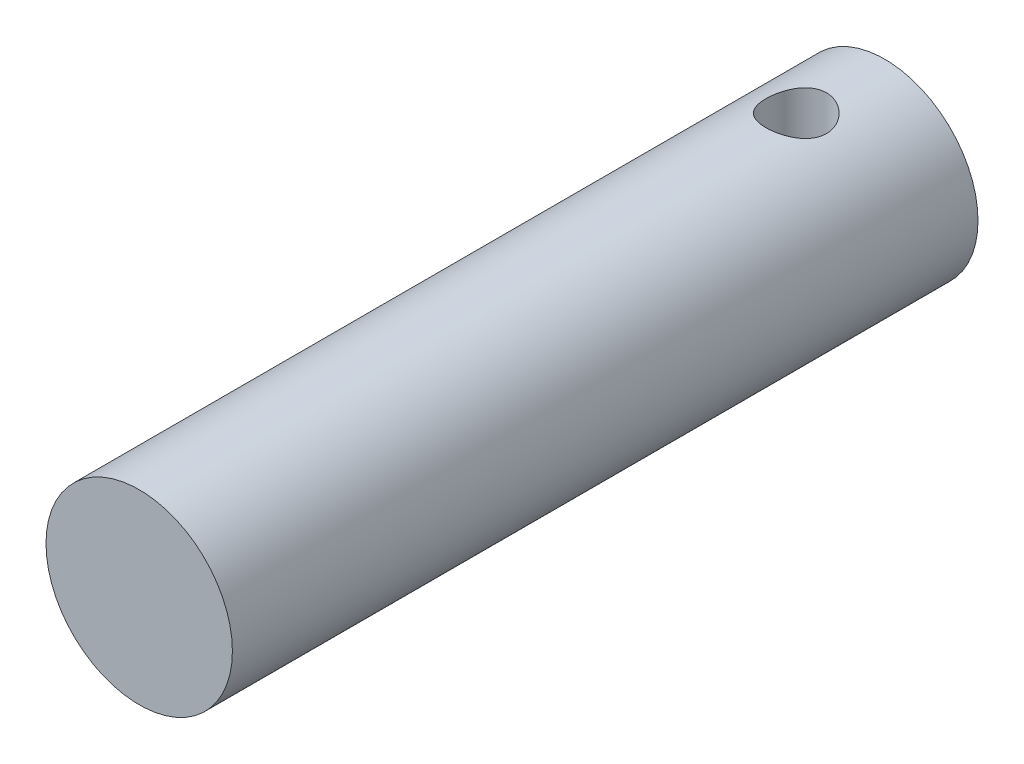
ISO-10303-21;
HEADER;
FILE_DESCRIPTION(('STEP AP214'),'2;1');
FILE_NAME('part.step','',(''),(''),'','','');
FILE_SCHEMA(('AUTOMOTIVE_DESIGN { 1 0 10303 214 1 1 1 1 }'));
ENDSEC;
DATA;
#1=APPLICATION_CONTEXT('core data for automotive mechanical design processes');
#2=APPLICATION_PROTOCOL_DEFINITION('international standard','automotive_design',2000,#1);
#3=PRODUCT_CONTEXT('',#1,'mechanical');
#4=PRODUCT('Part','Part','',(#3));
#5=PRODUCT_RELATED_PRODUCT_CATEGORY('part','',(#4));
#6=PRODUCT_DEFINITION_FORMATION('','',#4);
#7=PRODUCT_DEFINITION_CONTEXT('part definition',#1,'design');
#8=PRODUCT_DEFINITION('design','',#6,#7);
#9=PRODUCT_DEFINITION_SHAPE('','',#8);
#10=(LENGTH_UNIT() NAMED_UNIT(*) SI_UNIT(.MILLI.,.METRE.));
#11=(NAMED_UNIT(*) PLANE_ANGLE_UNIT() SI_UNIT($,.RADIAN.));
#12=(NAMED_UNIT(*) SI_UNIT($,.STERADIAN.) SOLID_ANGLE_UNIT());
#13=UNCERTAINTY_MEASURE_WITH_UNIT(LENGTH_MEASURE(1.E-05),#10,'distance_accuracy_value','');
#14=(GEOMETRIC_REPRESENTATION_CONTEXT(3) GLOBAL_UNCERTAINTY_ASSIGNED_CONTEXT((#13)) GLOBAL_UNIT_ASSIGNED_CONTEXT((#10,
#11,#12)) REPRESENTATION_CONTEXT('',''));
#15=CARTESIAN_POINT('',(0.,0.,0.));
#16=DIRECTION('',(0.,0.,1.));
#17=DIRECTION('',(1.,0.,0.));
#18=AXIS2_PLACEMENT_3D('',#15,#16,#17);
#19=CARTESIAN_POINT('',(0.,0.,80.));
#20=DIRECTION('',(0.,0.,-1.));
#21=DIRECTION('',(-1.,0.,0.));
#22=AXIS2_PLACEMENT_3D('',#19,#20,#21);
#23=CYLINDRICAL_SURFACE('',#22,10.);
#24=CARTESIAN_POINT('',(0.,-10.,12.75));
#25=CARTESIAN_POINT('',(0.177579382949037,-9.99999989374565,12.7499999788935));
#26=CARTESIAN_POINT('',(0.355160799428112,-9.99522579386108,12.7353980365284));
#27=CARTESIAN_POINT('',(0.705108112257464,-9.97665017824227,12.6775443332715));
#28=CARTESIAN_POINT('',(0.877473205641299,-9.96284727999528,12.6342881847613));
#29=CARTESIAN_POINT('',(1.21189182680224,-9.92771716006862,12.5207547728247));
#30=CARTESIAN_POINT('',(1.37396158278686,-9.90640214525769,12.4505213298079));
#31=CARTESIAN_POINT('',(1.68402262402101,-9.85843361438871,12.2852203482162));
#32=CARTESIAN_POINT('',(1.83201134569424,-9.83177912896556,12.1901482993111));
#33=CARTESIAN_POINT('',(2.11461081148199,-9.77495932247796,11.9745589387076));
#34=CARTESIAN_POINT('',(2.24869037174637,-9.74471295358528,11.8533668062036));
#35=CARTESIAN_POINT('',(2.49502344091046,-9.6845736848256,11.5904130339127));
#36=CARTESIAN_POINT('',(2.6072724549812,-9.65468085893924,11.4486471685403));
#37=CARTESIAN_POINT('',(2.80972801137824,-9.59775056049016,11.1438629732491));
#38=CARTESIAN_POINT('',(2.89925504445897,-9.57081237727236,10.9803729502016));
#39=CARTESIAN_POINT('',(3.049318871398,-9.52406830823476,10.6396400997919));
#40=CARTESIAN_POINT('',(3.10986401524675,-9.50426036852437,10.4624012507344));
#41=CARTESIAN_POINT('',(3.19827260971519,-9.4748706234853,10.1052240034781));
#42=CARTESIAN_POINT('',(3.2271274104268,-9.46497952226558,9.92555717035662));
#43=CARTESIAN_POINT('',(3.25443459132067,-9.45562707493594,9.56368104299375));
#44=CARTESIAN_POINT('',(3.25289582251765,-9.45616269242515,9.38147250437639));
#45=CARTESIAN_POINT('',(3.22023155138037,-9.46733131423128,9.02803492164185));
#46=CARTESIAN_POINT('',(3.19038591816139,-9.47752750417874,8.8566714242638));
#47=CARTESIAN_POINT('',(3.10403782395807,-9.50615574812355,8.52153026618225));
#48=CARTESIAN_POINT('',(3.04753231830217,-9.52458874278654,8.35775347425966));
#49=CARTESIAN_POINT('',(2.9086040418874,-9.56793440052134,8.03946972523123));
#50=CARTESIAN_POINT('',(2.82579288678077,-9.59294312913819,7.88514594174321));
#51=CARTESIAN_POINT('',(2.63687365185911,-9.64658062480913,7.59217407032713));
#52=CARTESIAN_POINT('',(2.53075911343127,-9.6752103945125,7.45353034435166));
#53=CARTESIAN_POINT('',(2.29204406554379,-9.73459644737762,7.18864419467052));
#54=CARTESIAN_POINT('',(2.15839298888212,-9.76538786414675,7.06335456075029));
#55=CARTESIAN_POINT('',(1.87159594889807,-9.82438470108506,6.83672493383306));
#56=CARTESIAN_POINT('',(1.71844829781997,-9.85258989700936,6.73538701643118));
#57=CARTESIAN_POINT('',(1.39505996296231,-9.90357541398691,6.55882041963745));
#58=CARTESIAN_POINT('',(1.22467751353947,-9.92630448856869,6.48383558140145));
#59=CARTESIAN_POINT('',(0.872803501369059,-9.96340575158467,6.36388245090137));
#60=CARTESIAN_POINT('',(0.69131562065941,-9.97778069343972,6.31890426808364));
#61=CARTESIAN_POINT('',(0.330457295677714,-9.99610319938068,6.26190268958609));
#62=CARTESIAN_POINT('',(0.151310774152583,-10.0004581918424,6.24859087614171));
#63=CARTESIAN_POINT('',(-0.206684753642986,-9.99946515119833,6.25164499537228));
#64=CARTESIAN_POINT('',(-0.385533802797546,-9.99411866512874,6.26800619627043));
#65=CARTESIAN_POINT('',(-0.732777014929081,-9.97459190888947,6.32891612541361));
#66=CARTESIAN_POINT('',(-0.901323284372865,-9.96065655544011,6.37268387411816));
#67=CARTESIAN_POINT('',(-1.22862125569252,-9.92560343144515,6.48619763987108));
#68=CARTESIAN_POINT('',(-1.38737171915065,-9.90448475494932,6.55594693377962));
#69=CARTESIAN_POINT('',(-1.69509055480488,-9.85654869030637,6.7214272702345));
#70=CARTESIAN_POINT('',(-1.84370519348154,-9.82959944293602,6.8177768248749));
#71=CARTESIAN_POINT('',(-2.12308150730875,-9.77306882676684,7.03298990397325));
#72=CARTESIAN_POINT('',(-2.25383795390917,-9.74348669127606,7.151859997817));
#73=CARTESIAN_POINT('',(-2.49964097258612,-9.68341394517995,7.41480097804423));
#74=CARTESIAN_POINT('',(-2.61376838975716,-9.65293908057767,7.55973674123745));
#75=CARTESIAN_POINT('',(-2.81618275812033,-9.59584349220032,7.86736100265518));
#76=CARTESIAN_POINT('',(-2.90446977360854,-9.56922275883548,8.03004945670606));
#77=CARTESIAN_POINT('',(-3.05222465357593,-9.52312626728824,8.3684525393954));
#78=CARTESIAN_POINT('',(-3.11177462835522,-9.50363019104654,8.54412838046303));
#79=CARTESIAN_POINT('',(-3.20020095668876,-9.47422438151486,8.90378778157255));
#80=CARTESIAN_POINT('',(-3.22909023717128,-9.4643106083648,9.08776780633169));
#81=CARTESIAN_POINT('',(-3.25439854839941,-9.45563586870718,9.44914011744297));
#82=CARTESIAN_POINT('',(-3.25233581624123,-9.45635339998916,9.62641479309743));
#83=CARTESIAN_POINT('',(-3.21950614466644,-9.46758016662914,9.97795399616682));
#84=CARTESIAN_POINT('',(-3.18874075712543,-9.47808887260453,10.1522186858048));
#85=CARTESIAN_POINT('',(-3.10043070730134,-9.50733511912922,10.4898321057282));
#86=CARTESIAN_POINT('',(-3.04335434275121,-9.52592844913925,10.6533167867785));
#87=CARTESIAN_POINT('',(-2.90441722996809,-9.5692021691022,10.9685171754486));
#88=CARTESIAN_POINT('',(-2.82255115849537,-9.59388386623479,11.1202303465038));
#89=CARTESIAN_POINT('',(-2.63235879697991,-9.64784088636398,11.4144561834634));
#90=CARTESIAN_POINT('',(-2.52306891129123,-9.67726517521805,11.5563185213747));
#91=CARTESIAN_POINT('',(-2.28278717900075,-9.73674387050347,11.8201809069832));
#92=CARTESIAN_POINT('',(-2.15178933442872,-9.76679844907541,11.9421754466285));
#93=CARTESIAN_POINT('',(-1.86608754817447,-9.82546252093759,12.1672967982182));
#94=CARTESIAN_POINT('',(-1.71069498742675,-9.85397977542082,12.2695765881428));
#95=CARTESIAN_POINT('',(-1.38400159009725,-9.90514098282108,12.4464406536773));
#96=CARTESIAN_POINT('',(-1.21270574929994,-9.92778677175249,12.5210335901562));
#97=CARTESIAN_POINT('',(-0.869832380696063,-9.96349655119001,12.6363330359905));
#98=CARTESIAN_POINT('',(-0.698908003473846,-9.97706030755102,12.6788273892005));
#99=CARTESIAN_POINT('',(-0.351988917437684,-9.9953110007797,12.7356574435725));
#100=CARTESIAN_POINT('',(-0.175995457426611,-10.0000001053066,12.7500000209183));
#101=CARTESIAN_POINT('',(0.,-10.,12.75));
#102=B_SPLINE_CURVE_WITH_KNOTS('',3,(#24,#25,#26,#27,#28,#29,#30,#31,#32,#33,#34,#35,#36,#37,
#38,#39,#40,#41,#42,#43,#44,#45,#46,#47,#48,#49,#50,#51,#52,#53,#54,#55,#56,#57,#58,#59,#60,#61,
#62,#63,#64,#65,#66,#67,#68,#69,#70,#71,#72,#73,#74,#75,#76,#77,#78,#79,#80,#81,#82,#83,#84,#85,
#86,#87,#88,#89,#90,#91,#92,#93,#94,#95,#96,#97,#98,#99,#100,#101),.UNSPECIFIED.,.T.,.F.,(4,2,2,
2,2,2,2,2,2,2,2,2,2,2,2,2,2,2,2,2,2,2,2,2,2,2,2,2,2,2,2,2,2,2,2,2,2,2,4),(0.,0.532090801254678,
1.06426309669592,1.59557459199055,2.12698263287681,2.67425296309553,3.22163585524026,
3.78384740278184,4.34589687356045,4.88981368187708,5.43357209666657,5.95386117923412,
6.47420969543027,7.0026288286568,7.53119460031028,8.08590846442153,8.64067038102186,
9.2004380558259,9.76002113320907,10.2964148728263,10.8327230844865,11.3544036147969,
11.8761499631049,12.4112318399367,12.9464700445872,13.5047604456698,14.0630494576023,
14.6197336846483,15.176183113382,15.7054311330744,16.2346505394039,16.7547941299287,
17.275049493252,17.8170673976499,18.3592353135956,18.9211107593865,19.4828102935623,
20.0102839458811,20.5376287446081),.UNSPECIFIED.);
#103=CARTESIAN_POINT('',(0.,-10.,12.75));
#104=VERTEX_POINT('',#103);
#105=EDGE_CURVE('E39',#104,#104,#102,.T.);
#106=ORIENTED_EDGE('',*,*,#105,.T.);
#107=EDGE_LOOP('',(#106));
#108=FACE_BOUND('',#107,.T.);
#109=CARTESIAN_POINT('',(0.,10.,12.75));
#110=CARTESIAN_POINT('',(-0.17757938294903,9.99999989374565,12.7499999788935));
#111=CARTESIAN_POINT('',(-0.355160799428105,9.99522579386108,12.7353980365284));
#112=CARTESIAN_POINT('',(-0.705108112257457,9.97665017824228,12.6775443332715));
#113=CARTESIAN_POINT('',(-0.877473205641292,9.96284727999529,12.6342881847613));
#114=CARTESIAN_POINT('',(-1.21189182680223,9.92771716006863,12.5207547728247));
#115=CARTESIAN_POINT('',(-1.37396158278685,9.90640214525769,12.4505213298079));
#116=CARTESIAN_POINT('',(-1.684022624021,9.85843361438871,12.2852203482162));
#117=CARTESIAN_POINT('',(-1.83201134569423,9.83177912896556,12.1901482993111));
#118=CARTESIAN_POINT('',(-2.11461081148198,9.77495932247796,11.9745589387076));
#119=CARTESIAN_POINT('',(-2.24869037174636,9.74471295358528,11.8533668062036));
#120=CARTESIAN_POINT('',(-2.49502344091045,9.6845736848256,11.5904130339127));
#121=CARTESIAN_POINT('',(-2.60727245498119,9.65468085893924,11.4486471685403));
#122=CARTESIAN_POINT('',(-2.80972801137823,9.59775056049016,11.1438629732491));
#123=CARTESIAN_POINT('',(-2.89925504445896,9.57081237727236,10.9803729502016));
#124=CARTESIAN_POINT('',(-3.04931887139799,9.52406830823476,10.6396400997919));
#125=CARTESIAN_POINT('',(-3.10986401524674,9.50426036852437,10.4624012507344));
#126=CARTESIAN_POINT('',(-3.19827260971519,9.4748706234853,10.1052240034781));
#127=CARTESIAN_POINT('',(-3.2271274104268,9.46497952226559,9.92555717035662));
#128=CARTESIAN_POINT('',(-3.25443459132067,9.45562707493594,9.56368104299375));
#129=CARTESIAN_POINT('',(-3.25289582251765,9.45616269242515,9.38147250437639));
#130=CARTESIAN_POINT('',(-3.22023155138037,9.46733131423128,9.02803492164185));
#131=CARTESIAN_POINT('',(-3.19038591816138,9.47752750417874,8.8566714242638));
#132=CARTESIAN_POINT('',(-3.10403782395806,9.50615574812356,8.52153026618225));
#133=CARTESIAN_POINT('',(-3.04753231830216,9.52458874278654,8.35775347425966));
#134=CARTESIAN_POINT('',(-2.90860404188739,9.56793440052134,8.03946972523123));
#135=CARTESIAN_POINT('',(-2.82579288678076,9.5929431291382,7.88514594174321));
#136=CARTESIAN_POINT('',(-2.6368736518591,9.64658062480913,7.59217407032713));
#137=CARTESIAN_POINT('',(-2.53075911343127,9.6752103945125,7.45353034435166));
#138=CARTESIAN_POINT('',(-2.29204406554378,9.73459644737762,7.18864419467052));
#139=CARTESIAN_POINT('',(-2.15839298888211,9.76538786414675,7.06335456075029));
#140=CARTESIAN_POINT('',(-1.87159594889806,9.82438470108506,6.83672493383306));
#141=CARTESIAN_POINT('',(-1.71844829781996,9.85258989700936,6.73538701643118));
#142=CARTESIAN_POINT('',(-1.3950599629623,9.90357541398691,6.55882041963745));
#143=CARTESIAN_POINT('',(-1.22467751353946,9.92630448856869,6.48383558140145));
#144=CARTESIAN_POINT('',(-0.872803501369051,9.96340575158467,6.36388245090137));
#145=CARTESIAN_POINT('',(-0.691315620659402,9.97778069343972,6.31890426808364));
#146=CARTESIAN_POINT('',(-0.330457295677706,9.99610319938068,6.26190268958609));
#147=CARTESIAN_POINT('',(-0.151310774152576,10.0004581918424,6.24859087614171));
#148=CARTESIAN_POINT('',(0.206684753642994,9.99946515119833,6.25164499537228));
#149=CARTESIAN_POINT('',(0.385533802797554,9.99411866512873,6.26800619627043));
#150=CARTESIAN_POINT('',(0.732777014929089,9.97459190888947,6.32891612541361));
#151=CARTESIAN_POINT('',(0.901323284372872,9.96065655544011,6.37268387411816));
#152=CARTESIAN_POINT('',(1.22862125569253,9.92560343144515,6.48619763987108));
#153=CARTESIAN_POINT('',(1.38737171915066,9.90448475494932,6.55594693377962));
#154=CARTESIAN_POINT('',(1.69509055480489,9.85654869030636,6.7214272702345));
#155=CARTESIAN_POINT('',(1.84370519348155,9.82959944293601,6.8177768248749));
#156=CARTESIAN_POINT('',(2.12308150730875,9.77306882676684,7.03298990397325));
#157=CARTESIAN_POINT('',(2.25383795390918,9.74348669127605,7.151859997817));
#158=CARTESIAN_POINT('',(2.49964097258612,9.68341394517995,7.41480097804423));
#159=CARTESIAN_POINT('',(2.61376838975717,9.65293908057767,7.55973674123745));
#160=CARTESIAN_POINT('',(2.81618275812033,9.59584349220032,7.86736100265518));
#161=CARTESIAN_POINT('',(2.90446977360854,9.56922275883548,8.03004945670606));
#162=CARTESIAN_POINT('',(3.05222465357594,9.52312626728824,8.3684525393954));
#163=CARTESIAN_POINT('',(3.11177462835522,9.50363019104654,8.54412838046303));
#164=CARTESIAN_POINT('',(3.20020095668876,9.47422438151486,8.90378778157254));
#165=CARTESIAN_POINT('',(3.22909023717129,9.4643106083648,9.08776780633168));
#166=CARTESIAN_POINT('',(3.25439854839942,9.45563586870717,9.44914011744297));
#167=CARTESIAN_POINT('',(3.25233581624124,9.45635339998916,9.62641479309743));
#168=CARTESIAN_POINT('',(3.21950614466645,9.46758016662914,9.97795399616682));
#169=CARTESIAN_POINT('',(3.18874075712544,9.47808887260453,10.1522186858048));
#170=CARTESIAN_POINT('',(3.10043070730134,9.50733511912922,10.4898321057282));
#171=CARTESIAN_POINT('',(3.04335434275122,9.52592844913925,10.6533167867785));
#172=CARTESIAN_POINT('',(2.9044172299681,9.56920216910219,10.9685171754486));
#173=CARTESIAN_POINT('',(2.82255115849538,9.59388386623479,11.1202303465038));
#174=CARTESIAN_POINT('',(2.63235879697992,9.64784088636397,11.4144561834634));
#175=CARTESIAN_POINT('',(2.52306891129124,9.67726517521804,11.5563185213747));
#176=CARTESIAN_POINT('',(2.28278717900076,9.73674387050347,11.8201809069832));
#177=CARTESIAN_POINT('',(2.15178933442872,9.76679844907541,11.9421754466285));
#178=CARTESIAN_POINT('',(1.86608754817448,9.82546252093759,12.1672967982182));
#179=CARTESIAN_POINT('',(1.71069498742676,9.85397977542082,12.2695765881428));
#180=CARTESIAN_POINT('',(1.38400159009726,9.90514098282108,12.4464406536773));
#181=CARTESIAN_POINT('',(1.21270574929995,9.92778677175249,12.5210335901562));
#182=CARTESIAN_POINT('',(0.869832380696071,9.96349655119002,12.6363330359905));
#183=CARTESIAN_POINT('',(0.698908003473853,9.97706030755102,12.6788273892005));
#184=CARTESIAN_POINT('',(0.351988917437691,9.9953110007797,12.7356574435725));
#185=CARTESIAN_POINT('',(0.175995457426618,10.0000001053066,12.7500000209183));
#186=CARTESIAN_POINT('',(0.,10.,12.75));
#187=B_SPLINE_CURVE_WITH_KNOTS('',3,(#109,#110,#111,#112,#113,#114,#115,#116,#117,#118,#119,
#120,#121,#122,#123,#124,#125,#126,#127,#128,#129,#130,#131,#132,#133,#134,#135,#136,#137,#138,
#139,#140,#141,#142,#143,#144,#145,#146,#147,#148,#149,#150,#151,#152,#153,#154,#155,#156,#157,
#158,#159,#160,#161,#162,#163,#164,#165,#166,#167,#168,#169,#170,#171,#172,#173,#174,#175,#176,
#177,#178,#179,#180,#181,#182,#183,#184,#185,#186),.UNSPECIFIED.,.T.,.F.,(4,2,2,2,2,2,2,2,2,2,2,
2,2,2,2,2,2,2,2,2,2,2,2,2,2,2,2,2,2,2,2,2,2,2,2,2,2,2,4),(0.,0.532090801254678,1.06426309669592,
1.59557459199055,2.12698263287681,2.67425296309553,3.22163585524026,3.78384740278184,
4.34589687356045,4.88981368187708,5.43357209666657,5.95386117923412,6.47420969543027,
7.0026288286568,7.53119460031028,8.08590846442153,8.64067038102186,9.2004380558259,
9.76002113320907,10.2964148728263,10.8327230844865,11.3544036147969,11.8761499631049,
12.4112318399367,12.9464700445872,13.5047604456698,14.0630494576023,14.6197336846483,
15.176183113382,15.7054311330744,16.2346505394039,16.7547941299287,17.275049493252,
17.8170673976499,18.3592353135956,18.9211107593865,19.4828102935623,20.0102839458811,
20.5376287446081),.UNSPECIFIED.);
#188=CARTESIAN_POINT('',(0.,10.,12.75));
#189=VERTEX_POINT('',#188);
#190=EDGE_CURVE('E53',#189,#189,#187,.T.);
#191=ORIENTED_EDGE('',*,*,#190,.T.);
#192=EDGE_LOOP('',(#191));
#193=FACE_BOUND('',#192,.T.);
#194=CARTESIAN_POINT('',(0.,0.,80.));
#195=DIRECTION('',(0.,0.,1.));
#196=DIRECTION('',(1.,0.,0.));
#197=AXIS2_PLACEMENT_3D('',#194,#195,#196);
#198=CIRCLE('',#197,10.);
#199=CARTESIAN_POINT('',(10.,0.,80.));
#200=VERTEX_POINT('',#199);
#201=EDGE_CURVE('E10',#200,#200,#198,.T.);
#202=ORIENTED_EDGE('',*,*,#201,.F.);
#203=EDGE_LOOP('',(#202));
#204=FACE_BOUND('',#203,.T.);
#205=CARTESIAN_POINT('',(0.,0.,0.));
#206=DIRECTION('',(0.,0.,1.));
#207=DIRECTION('',(1.,0.,0.));
#208=AXIS2_PLACEMENT_3D('',#205,#206,#207);
#209=CIRCLE('',#208,10.);
#210=CARTESIAN_POINT('',(10.,0.,0.));
#211=VERTEX_POINT('',#210);
#212=EDGE_CURVE('E47',#211,#211,#209,.T.);
#213=ORIENTED_EDGE('',*,*,#212,.T.);
#214=EDGE_LOOP('',(#213));
#215=FACE_BOUND('',#214,.T.);
#216=ADVANCED_FACE('F35',(#108,#193,#204,#215),#23,.T.);
#217=CARTESIAN_POINT('',(0.,0.,80.));
#218=DIRECTION('',(0.,0.,1.));
#219=DIRECTION('',(1.,0.,0.));
#220=AXIS2_PLACEMENT_3D('',#217,#218,#219);
#221=PLANE('',#220);
#222=ORIENTED_EDGE('',*,*,#201,.T.);
#223=EDGE_LOOP('',(#222));
#224=FACE_BOUND('',#223,.T.);
#225=ADVANCED_FACE('F64',(#224),#221,.T.);
#226=CARTESIAN_POINT('',(0.,0.,0.));
#227=DIRECTION('',(0.,0.,1.));
#228=DIRECTION('',(1.,0.,0.));
#229=AXIS2_PLACEMENT_3D('',#226,#227,#228);
#230=PLANE('',#229);
#231=ORIENTED_EDGE('',*,*,#212,.F.);
#232=EDGE_LOOP('',(#231));
#233=FACE_BOUND('',#232,.T.);
#234=ADVANCED_FACE('F62',(#233),#230,.F.);
#235=CARTESIAN_POINT('',(0.,-210.,9.5));
#236=DIRECTION('',(0.,1.,0.));
#237=DIRECTION('',(0.,0.,1.));
#238=AXIS2_PLACEMENT_3D('',#235,#236,#237);
#239=CYLINDRICAL_SURFACE('',#238,3.25);
#240=ORIENTED_EDGE('',*,*,#190,.F.);
#241=EDGE_LOOP('',(#240));
#242=FACE_BOUND('',#241,.T.);
#243=ORIENTED_EDGE('',*,*,#105,.F.);
#244=EDGE_LOOP('',(#243));
#245=FACE_BOUND('',#244,.T.);
#246=ADVANCED_FACE('F58',(#242,#245),#239,.F.);
#247=CLOSED_SHELL('',(#216,#225,#234,#246));
#248=MANIFOLD_SOLID_BREP('B2',#247);
#249=ADVANCED_BREP_SHAPE_REPRESENTATION('',(#18,#248),#14);
#250=SHAPE_DEFINITION_REPRESENTATION(#9,#249);
ENDSEC;
END-ISO-10303-21;
